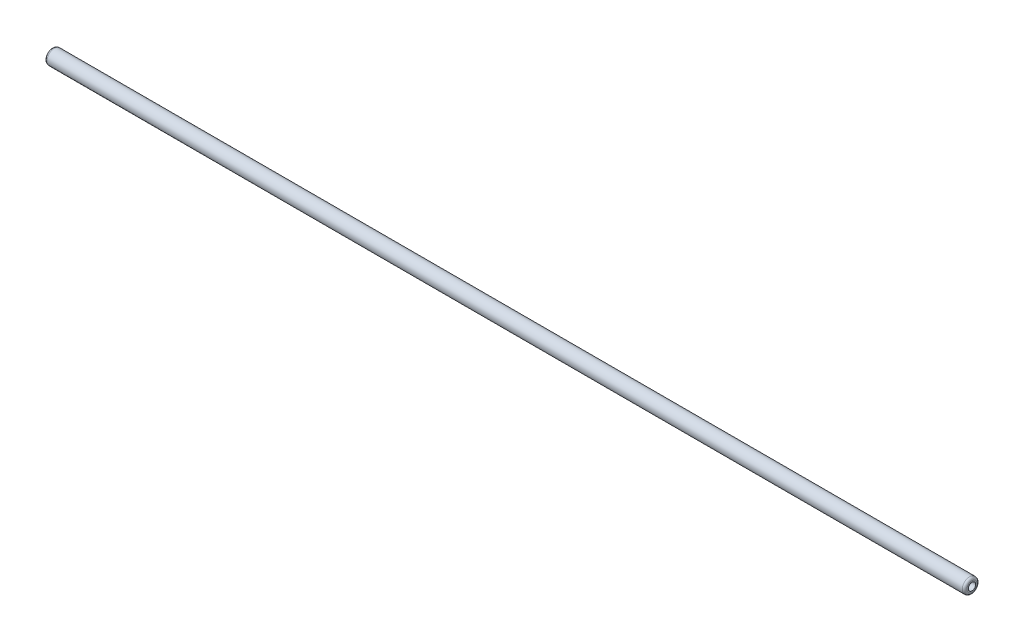
ISO-10303-21;
HEADER;
FILE_DESCRIPTION(('STEP AP214'),'2;1');
FILE_NAME('part.step','',(''),(''),'','','');
FILE_SCHEMA(('AUTOMOTIVE_DESIGN { 1 0 10303 214 1 1 1 1 }'));
ENDSEC;
DATA;
#1=APPLICATION_CONTEXT('core data for automotive mechanical design processes');
#2=APPLICATION_PROTOCOL_DEFINITION('international standard','automotive_design',2000,#1);
#3=PRODUCT_CONTEXT('',#1,'mechanical');
#4=PRODUCT('Part','Part','',(#3));
#5=PRODUCT_RELATED_PRODUCT_CATEGORY('part','',(#4));
#6=PRODUCT_DEFINITION_FORMATION('','',#4);
#7=PRODUCT_DEFINITION_CONTEXT('part definition',#1,'design');
#8=PRODUCT_DEFINITION('design','',#6,#7);
#9=PRODUCT_DEFINITION_SHAPE('','',#8);
#10=(LENGTH_UNIT() NAMED_UNIT(*) SI_UNIT(.MILLI.,.METRE.));
#11=(NAMED_UNIT(*) PLANE_ANGLE_UNIT() SI_UNIT($,.RADIAN.));
#12=(NAMED_UNIT(*) SI_UNIT($,.STERADIAN.) SOLID_ANGLE_UNIT());
#13=UNCERTAINTY_MEASURE_WITH_UNIT(LENGTH_MEASURE(1.E-05),#10,'distance_accuracy_value','');
#14=(GEOMETRIC_REPRESENTATION_CONTEXT(3) GLOBAL_UNCERTAINTY_ASSIGNED_CONTEXT((#13)) GLOBAL_UNIT_ASSIGNED_CONTEXT((#10,
#11,#12)) REPRESENTATION_CONTEXT('',''));
#15=CARTESIAN_POINT('',(0.,0.,0.));
#16=DIRECTION('',(0.,0.,1.));
#17=DIRECTION('',(1.,0.,0.));
#18=AXIS2_PLACEMENT_3D('',#15,#16,#17);
#19=CARTESIAN_POINT('',(-493.649,-6.56531075829067E-10,0.));
#20=DIRECTION('',(-1.,-1.32995524315671E-12,0.));
#21=DIRECTION('',(0.,0.,1.));
#22=AXIS2_PLACEMENT_3D('',#19,#20,#21);
#23=PLANE('',#22);
#24=CARTESIAN_POINT('',(-493.649,-6.56531075829067E-10,0.));
#25=DIRECTION('',(-1.,-1.32995524315671E-12,0.));
#26=DIRECTION('',(0.,0.,1.));
#27=AXIS2_PLACEMENT_3D('',#24,#25,#26);
#28=CIRCLE('',#27,5.4375);
#29=CARTESIAN_POINT('',(-493.649,-6.56531075829067E-10,5.4375));
#30=VERTEX_POINT('',#29);
#31=EDGE_CURVE('E10',#30,#30,#28,.T.);
#32=ORIENTED_EDGE('',*,*,#31,.T.);
#33=EDGE_LOOP('',(#32));
#34=FACE_BOUND('',#33,.T.);
#35=CARTESIAN_POINT('',(-493.649,-6.56531075829067E-10,0.));
#36=DIRECTION('',(-1.,-1.32995524315671E-12,0.));
#37=DIRECTION('',(0.,0.,1.));
#38=AXIS2_PLACEMENT_3D('',#35,#36,#37);
#39=CIRCLE('',#38,3.975);
#40=CARTESIAN_POINT('',(-493.649,-6.56531075829067E-10,3.975));
#41=VERTEX_POINT('',#40);
#42=EDGE_CURVE('E66',#41,#41,#39,.T.);
#43=ORIENTED_EDGE('',*,*,#42,.F.);
#44=EDGE_LOOP('',(#43));
#45=FACE_BOUND('',#44,.T.);
#46=ADVANCED_FACE('F42',(#34,#45),#23,.T.);
#47=CARTESIAN_POINT('',(493.649,6.56531075829067E-10,0.));
#48=DIRECTION('',(-1.,-1.32995524315671E-12,0.));
#49=DIRECTION('',(0.,0.,1.));
#50=AXIS2_PLACEMENT_3D('',#47,#48,#49);
#51=PLANE('',#50);
#52=CARTESIAN_POINT('',(493.649,6.56531075829067E-10,0.));
#53=DIRECTION('',(-1.,-1.32995524315671E-12,0.));
#54=DIRECTION('',(0.,0.,1.));
#55=AXIS2_PLACEMENT_3D('',#52,#53,#54);
#56=CIRCLE('',#55,5.4375);
#57=CARTESIAN_POINT('',(493.649,6.56531075829067E-10,5.4375));
#58=VERTEX_POINT('',#57);
#59=EDGE_CURVE('E50',#58,#58,#56,.F.);
#60=ORIENTED_EDGE('',*,*,#59,.T.);
#61=EDGE_LOOP('',(#60));
#62=FACE_BOUND('',#61,.T.);
#63=CARTESIAN_POINT('',(493.649,6.56531075829067E-10,0.));
#64=DIRECTION('',(-1.,-1.32995524315671E-12,0.));
#65=DIRECTION('',(0.,0.,1.));
#66=AXIS2_PLACEMENT_3D('',#63,#64,#65);
#67=CIRCLE('',#66,3.975);
#68=CARTESIAN_POINT('',(493.649,6.56531075829067E-10,3.975));
#69=VERTEX_POINT('',#68);
#70=EDGE_CURVE('E67',#69,#69,#67,.T.);
#71=ORIENTED_EDGE('',*,*,#70,.T.);
#72=EDGE_LOOP('',(#71));
#73=FACE_BOUND('',#72,.T.);
#74=ADVANCED_FACE('F79',(#62,#73),#51,.F.);
#75=CARTESIAN_POINT('',(-493.649,-6.56531075829067E-10,0.));
#76=DIRECTION('',(1.,1.32995524315671E-12,0.));
#77=DIRECTION('',(0.,0.,-1.));
#78=AXIS2_PLACEMENT_3D('',#75,#76,#77);
#79=CYLINDRICAL_SURFACE('',#78,7.9375);
#80=CARTESIAN_POINT('',(491.149,6.53206187721175E-10,0.));
#81=DIRECTION('',(-1.,-1.32995524315671E-12,0.));
#82=DIRECTION('',(0.,0.,1.));
#83=AXIS2_PLACEMENT_3D('',#80,#81,#82);
#84=CIRCLE('',#83,7.9375);
#85=CARTESIAN_POINT('',(491.149,6.53206187721175E-10,7.9375));
#86=VERTEX_POINT('',#85);
#87=EDGE_CURVE('E55',#86,#86,#84,.T.);
#88=ORIENTED_EDGE('',*,*,#87,.T.);
#89=EDGE_LOOP('',(#88));
#90=FACE_BOUND('',#89,.T.);
#91=CARTESIAN_POINT('',(-491.149,-6.53206187721175E-10,0.));
#92=DIRECTION('',(-1.,-1.32995524315671E-12,0.));
#93=DIRECTION('',(0.,0.,1.));
#94=AXIS2_PLACEMENT_3D('',#91,#92,#93);
#95=CIRCLE('',#94,7.9375);
#96=CARTESIAN_POINT('',(-491.149,-6.53206187721175E-10,7.9375));
#97=VERTEX_POINT('',#96);
#98=EDGE_CURVE('E60',#97,#97,#95,.F.);
#99=ORIENTED_EDGE('',*,*,#98,.T.);
#100=EDGE_LOOP('',(#99));
#101=FACE_BOUND('',#100,.T.);
#102=ADVANCED_FACE('F84',(#90,#101),#79,.T.);
#103=CARTESIAN_POINT('',(-493.649,-6.56531075829067E-10,0.));
#104=DIRECTION('',(1.,1.32995524315671E-12,0.));
#105=DIRECTION('',(0.,0.,-1.));
#106=AXIS2_PLACEMENT_3D('',#103,#104,#105);
#107=CYLINDRICAL_SURFACE('',#106,3.975);
#108=ORIENTED_EDGE('',*,*,#42,.T.);
#109=EDGE_LOOP('',(#108));
#110=FACE_BOUND('',#109,.T.);
#111=ORIENTED_EDGE('',*,*,#70,.F.);
#112=EDGE_LOOP('',(#111));
#113=FACE_BOUND('',#112,.T.);
#114=ADVANCED_FACE('F75',(#110,#113),#107,.F.);
#115=CARTESIAN_POINT('',(491.149,6.53206187721175E-10,0.));
#116=DIRECTION('',(-1.,-1.32995524315671E-12,0.));
#117=DIRECTION('',(0.,0.,1.));
#118=AXIS2_PLACEMENT_3D('',#115,#116,#117);
#119=TOROIDAL_SURFACE('',#118,5.4375,2.5);
#120=ORIENTED_EDGE('',*,*,#59,.F.);
#121=EDGE_LOOP('',(#120));
#122=FACE_BOUND('',#121,.T.);
#123=ORIENTED_EDGE('',*,*,#87,.F.);
#124=EDGE_LOOP('',(#123));
#125=FACE_BOUND('',#124,.T.);
#126=ADVANCED_FACE('F90',(#122,#125),#119,.T.);
#127=CARTESIAN_POINT('',(-491.149,-6.53206187721175E-10,0.));
#128=DIRECTION('',(-1.,-1.32995524315671E-12,0.));
#129=DIRECTION('',(0.,0.,1.));
#130=AXIS2_PLACEMENT_3D('',#127,#128,#129);
#131=TOROIDAL_SURFACE('',#130,5.4375,2.5);
#132=ORIENTED_EDGE('',*,*,#98,.F.);
#133=EDGE_LOOP('',(#132));
#134=FACE_BOUND('',#133,.T.);
#135=ORIENTED_EDGE('',*,*,#31,.F.);
#136=EDGE_LOOP('',(#135));
#137=FACE_BOUND('',#136,.T.);
#138=ADVANCED_FACE('F44',(#134,#137),#131,.T.);
#139=CLOSED_SHELL('',(#46,#74,#102,#114,#126,#138));
#140=MANIFOLD_SOLID_BREP('B2',#139);
#141=ADVANCED_BREP_SHAPE_REPRESENTATION('',(#18,#140),#14);
#142=SHAPE_DEFINITION_REPRESENTATION(#9,#141);
ENDSEC;
END-ISO-10303-21;
